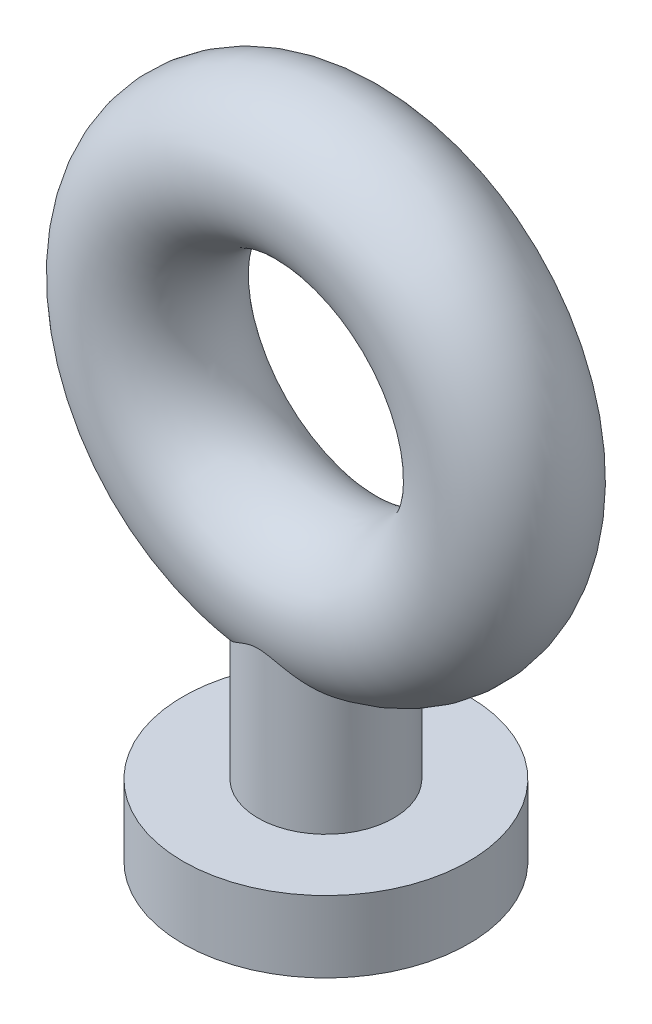
ISO-10303-21;
HEADER;
FILE_DESCRIPTION(('STEP AP214'),'2;1');
FILE_NAME('part.step','',(''),(''),'','','');
FILE_SCHEMA(('AUTOMOTIVE_DESIGN { 1 0 10303 214 1 1 1 1 }'));
ENDSEC;
DATA;
#1=APPLICATION_CONTEXT('core data for automotive mechanical design processes');
#2=APPLICATION_PROTOCOL_DEFINITION('international standard','automotive_design',2000,#1);
#3=PRODUCT_CONTEXT('',#1,'mechanical');
#4=PRODUCT('Part','Part','',(#3));
#5=PRODUCT_RELATED_PRODUCT_CATEGORY('part','',(#4));
#6=PRODUCT_DEFINITION_FORMATION('','',#4);
#7=PRODUCT_DEFINITION_CONTEXT('part definition',#1,'design');
#8=PRODUCT_DEFINITION('design','',#6,#7);
#9=PRODUCT_DEFINITION_SHAPE('','',#8);
#10=(LENGTH_UNIT() NAMED_UNIT(*) SI_UNIT(.MILLI.,.METRE.));
#11=(NAMED_UNIT(*) PLANE_ANGLE_UNIT() SI_UNIT($,.RADIAN.));
#12=(NAMED_UNIT(*) SI_UNIT($,.STERADIAN.) SOLID_ANGLE_UNIT());
#13=UNCERTAINTY_MEASURE_WITH_UNIT(LENGTH_MEASURE(1.E-05),#10,'distance_accuracy_value','');
#14=(GEOMETRIC_REPRESENTATION_CONTEXT(3) GLOBAL_UNCERTAINTY_ASSIGNED_CONTEXT((#13)) GLOBAL_UNIT_ASSIGNED_CONTEXT((#10,
#11,#12)) REPRESENTATION_CONTEXT('',''));
#15=CARTESIAN_POINT('',(0.,0.,0.));
#16=DIRECTION('',(0.,0.,1.));
#17=DIRECTION('',(1.,0.,0.));
#18=AXIS2_PLACEMENT_3D('',#15,#16,#17);
#19=CARTESIAN_POINT('',(0.,0.,0.));
#20=DIRECTION('',(0.,1.,0.));
#21=DIRECTION('',(0.,0.,1.));
#22=AXIS2_PLACEMENT_3D('',#19,#20,#21);
#23=CYLINDRICAL_SURFACE('',#22,0.95);
#24=CARTESIAN_POINT('',(0.,-4.86860505254029,0.));
#25=DIRECTION('',(0.,1.,0.));
#26=DIRECTION('',(0.,0.,1.));
#27=AXIS2_PLACEMENT_3D('',#24,#25,#26);
#28=CIRCLE('',#27,0.95);
#29=CARTESIAN_POINT('',(0.,-4.86860505254029,0.95));
#30=VERTEX_POINT('',#29);
#31=EDGE_CURVE('E66',#30,#30,#28,.T.);
#32=ORIENTED_EDGE('',*,*,#31,.T.);
#33=EDGE_LOOP('',(#32));
#34=FACE_BOUND('',#33,.T.);
#35=CARTESIAN_POINT('',(-0.696763898676524,-3.18828419711268,-0.645770911005669));
#36=CARTESIAN_POINT('',(-0.728218847321771,-3.21079399925205,-0.611830957627065));
#37=CARTESIAN_POINT('',(-0.757673621164826,-3.23187776941266,-0.575075691256959));
#38=CARTESIAN_POINT('',(-0.811501310502905,-3.27033594344044,-0.496227270304893));
#39=CARTESIAN_POINT('',(-0.835874325742483,-3.28771042011365,-0.454134220518818));
#40=CARTESIAN_POINT('',(-0.878466257033363,-3.31800284822494,-0.365033924856872));
#41=CARTESIAN_POINT('',(-0.896642076286018,-3.33088960368,-0.317995127234892));
#42=CARTESIAN_POINT('',(-0.925436310570067,-3.35127183489072,-0.220549542115327));
#43=CARTESIAN_POINT('',(-0.936060459456842,-3.35877140109386,-0.170145341791524));
#44=CARTESIAN_POINT('',(-0.948322769549391,-3.36742370741637,-0.0730153438486468));
#45=CARTESIAN_POINT('',(-0.950769629965446,-3.36914767890903,-0.0264413420422277));
#46=CARTESIAN_POINT('',(-0.948808418492038,-3.36776493098177,0.0664818099568839));
#47=CARTESIAN_POINT('',(-0.944402418717841,-3.36465967178759,0.112831023868705));
#48=CARTESIAN_POINT('',(-0.92946222484854,-3.35411126152607,0.201235732284493));
#49=CARTESIAN_POINT('',(-0.919292662607049,-3.34692617375988,0.243385228369109));
#50=CARTESIAN_POINT('',(-0.893646657893527,-3.32876485179232,0.325166458398984));
#51=CARTESIAN_POINT('',(-0.878169239076485,-3.3177879201037,0.364797727542305));
#52=CARTESIAN_POINT('',(-0.84156838644661,-3.29176331993058,0.442982275142506));
#53=CARTESIAN_POINT('',(-0.820168914123534,-3.27651601329527,0.481338771959613));
#54=CARTESIAN_POINT('',(-0.773098427935392,-3.24290597546141,0.553793673886458));
#55=CARTESIAN_POINT('',(-0.747426902628221,-3.22454287124029,0.587891568307757));
#56=CARTESIAN_POINT('',(-0.688629957631823,-3.18246011816435,0.65620587961971));
#57=CARTESIAN_POINT('',(-0.654963478119058,-3.15834984131443,0.689714167439253));
#58=CARTESIAN_POINT('',(-0.584039856039715,-3.10782146491033,0.750726997825198));
#59=CARTESIAN_POINT('',(-0.546775940033788,-3.08139902099313,0.778219883520198));
#60=CARTESIAN_POINT('',(-0.461293902431149,-3.02173494328938,0.832335894116992));
#61=CARTESIAN_POINT('',(-0.412403897759274,-2.98821291361477,0.857603909527551));
#62=CARTESIAN_POINT('',(-0.335741099856958,-2.93918587695105,0.889121689269841));
#63=CARTESIAN_POINT('',(-0.309631213598694,-2.92305231419944,0.898563797708693));
#64=CARTESIAN_POINT('',(-0.256003626500701,-2.89208399743116,0.915287691187096));
#65=CARTESIAN_POINT('',(-0.228488339402474,-2.87724712783317,0.922573043211896));
#66=CARTESIAN_POINT('',(-0.177546767365494,-2.85326376314162,0.933544695141548));
#67=CARTESIAN_POINT('',(-0.154476690946077,-2.84357670272075,0.937665618098753));
#68=CARTESIAN_POINT('',(-0.107065245076035,-2.82745095050136,0.944247206662159));
#69=CARTESIAN_POINT('',(-0.0827323320424527,-2.82099312099631,0.946717683519849));
#70=CARTESIAN_POINT('',(-0.0385253668218616,-2.81384482082535,0.949416936039279));
#71=CARTESIAN_POINT('',(-0.0188365263228334,-2.81220356214194,0.950017155676853));
#72=CARTESIAN_POINT('',(0.0205359886927932,-2.81229829328721,0.949982084289162));
#73=CARTESIAN_POINT('',(0.0402196608764162,-2.81403508425309,0.949346500181084));
#74=CARTESIAN_POINT('',(0.0849964346940136,-2.82147830061631,0.946532633172589));
#75=CARTESIAN_POINT('',(0.109876558410853,-2.82824768270819,0.943937480896253));
#76=CARTESIAN_POINT('',(0.158308454419732,-2.8450663902744,0.937040154582156));
#77=CARTESIAN_POINT('',(0.181851819714218,-2.85513424519585,0.932728306707764));
#78=CARTESIAN_POINT('',(0.229519650822813,-2.87793922208358,0.922204797159761));
#79=CARTESIAN_POINT('',(0.253543809033717,-2.89082413443579,0.915870240514275));
#80=CARTESIAN_POINT('',(0.300496299525538,-2.91765378276144,0.901556389787493));
#81=CARTESIAN_POINT('',(0.32342341983155,-2.93159964873004,0.893575326123087));
#82=CARTESIAN_POINT('',(0.390884348107463,-2.97407423531471,0.867206894228056));
#83=CARTESIAN_POINT('',(0.434091355700455,-3.00323644942488,0.846395744317719));
#84=CARTESIAN_POINT('',(0.523530338954301,-3.06492469544428,0.794643363622529));
#85=CARTESIAN_POINT('',(0.569259944368337,-3.09730782814545,0.762657245896328));
#86=CARTESIAN_POINT('',(0.655579043929067,-3.1587744508538,0.689847314227872));
#87=CARTESIAN_POINT('',(0.696177963057149,-3.18786398060785,0.649040089755713));
#88=CARTESIAN_POINT('',(0.762915651659737,-3.23562474917575,0.568000587759033));
#89=CARTESIAN_POINT('',(0.790314860244422,-3.25521082126867,0.529348235897745));
#90=CARTESIAN_POINT('',(0.839631877592448,-3.29038879258875,0.44700909354057));
#91=CARTESIAN_POINT('',(0.861551257477193,-3.30598183668801,0.403323751312626));
#92=CARTESIAN_POINT('',(0.898848800807241,-3.33245830331798,0.311513096404165));
#93=CARTESIAN_POINT('',(0.914182454042752,-3.34330968722826,0.263360166194992));
#94=CARTESIAN_POINT('',(0.937051979547711,-3.35947484687004,0.164344263781611));
#95=CARTESIAN_POINT('',(0.944593229751674,-3.36479244176944,0.11348318613362));
#96=CARTESIAN_POINT('',(0.950941113508018,-3.36926883237029,0.0168366346716164));
#97=CARTESIAN_POINT('',(0.950649493203931,-3.36906344827841,-0.0288627249587378));
#98=CARTESIAN_POINT('',(0.943550211474996,-3.36405658804605,-0.119486456059303));
#99=CARTESIAN_POINT('',(0.936744053211345,-3.35925617216089,-0.1644110038749));
#100=CARTESIAN_POINT('',(0.917365839412351,-3.34556066478744,-0.250653771087802));
#101=CARTESIAN_POINT('',(0.905001527033839,-3.33681306340681,-0.292042995148871));
#102=CARTESIAN_POINT('',(0.875198004225997,-3.31567553920812,-0.371952207812546));
#103=CARTESIAN_POINT('',(0.857757573906527,-3.30328474085148,-0.410471503917446));
#104=CARTESIAN_POINT('',(0.817008702536031,-3.27426200688741,-0.486840325111872));
#105=CARTESIAN_POINT('',(0.793349058616358,-3.25737493742377,-0.52440409240209));
#106=CARTESIAN_POINT('',(0.741923653216614,-3.22060808849868,-0.594942906200059));
#107=CARTESIAN_POINT('',(0.714156926485797,-3.20072760550238,-0.627916870461965));
#108=CARTESIAN_POINT('',(0.65063440784964,-3.15528081830851,-0.693972236426796));
#109=CARTESIAN_POINT('',(0.614310945710372,-3.1293135359644,-0.726229607281698));
#110=CARTESIAN_POINT('',(0.538152194610975,-3.07535432807819,-0.784342710438715));
#111=CARTESIAN_POINT('',(0.498311103301728,-3.04735907156823,-0.810187587343362));
#112=CARTESIAN_POINT('',(0.416363886816308,-2.99129460848093,-0.855156262842273));
#113=CARTESIAN_POINT('',(0.374315177584785,-2.96323691254012,-0.874398428381151));
#114=CARTESIAN_POINT('',(0.308701020865761,-2.92264900761148,-0.898745860767624));
#115=CARTESIAN_POINT('',(0.286415270176564,-2.90937434541706,-0.906107051697245));
#116=CARTESIAN_POINT('',(0.240778078045958,-2.8839593924731,-0.919288021082097));
#117=CARTESIAN_POINT('',(0.21742796063809,-2.87181774668027,-0.925109656480418));
#118=CARTESIAN_POINT('',(0.172533173016308,-2.85116133444168,-0.934444287039276));
#119=CARTESIAN_POINT('',(0.151157591829113,-2.84237932246816,-0.93816068474158));
#120=CARTESIAN_POINT('',(0.107305065322955,-2.82760477084777,-0.944177510623013));
#121=CARTESIAN_POINT('',(0.0848330096534443,-2.8216009106366,-0.946483697790136));
#122=CARTESIAN_POINT('',(0.0428331561154131,-2.81435859637301,-0.949226277916959));
#123=CARTESIAN_POINT('',(0.0234355792653986,-2.81249469438447,-0.949909440860042));
#124=CARTESIAN_POINT('',(-0.0153969585580703,-2.812051095747,-0.95007355397331));
#125=CARTESIAN_POINT('',(-0.0348319015485765,-2.81347009032789,-0.949554983230407));
#126=CARTESIAN_POINT('',(-0.0787443165753809,-2.82010710353746,-0.947055686534081));
#127=CARTESIAN_POINT('',(-0.103043001323396,-2.82631066256103,-0.944693313804465));
#128=CARTESIAN_POINT('',(-0.15039146557435,-2.84199162884951,-0.938328469361566));
#129=CARTESIAN_POINT('',(-0.173433274864858,-2.85148762552468,-0.934316660350792));
#130=CARTESIAN_POINT('',(-0.219905584228214,-2.8730624246622,-0.924523589915944));
#131=CARTESIAN_POINT('',(-0.243249109293966,-2.88527605397779,-0.918637583208756));
#132=CARTESIAN_POINT('',(-0.28887797196345,-2.91081126354064,-0.90532534621926));
#133=CARTESIAN_POINT('',(-0.311162093103603,-2.92413407132941,-0.897897395504021));
#134=CARTESIAN_POINT('',(-0.376741585843376,-2.96482209272173,-0.873356306929112));
#135=CARTESIAN_POINT('',(-0.418762847436369,-2.99290624129647,-0.853986204676925));
#136=CARTESIAN_POINT('',(-0.502664069732971,-3.05036842265368,-0.807633936876057));
#137=CARTESIAN_POINT('',(-0.54433509588103,-3.07970240638167,-0.780219491576516));
#138=CARTESIAN_POINT('',(-0.623758893156194,-3.13604702504012,-0.718298592774004));
#139=CARTESIAN_POINT('',(-0.661517132508936,-3.16306089309673,-0.683802243180654));
#140=CARTESIAN_POINT('',(-0.696763898676524,-3.18828419711268,-0.645770911005669));
#141=B_SPLINE_CURVE_WITH_KNOTS('',3,(#35,#36,#37,#38,#39,#40,#41,#42,#43,#44,#45,#46,#47,#48,
#49,#50,#51,#52,#53,#54,#55,#56,#57,#58,#59,#60,#61,#62,#63,#64,#65,#66,#67,#68,#69,#70,#71,#72,
#73,#74,#75,#76,#77,#78,#79,#80,#81,#82,#83,#84,#85,#86,#87,#88,#89,#90,#91,#92,#93,#94,#95,#96,
#97,#98,#99,#100,#101,#102,#103,#104,#105,#106,#107,#108,#109,#110,#111,#112,#113,#114,#115,
#116,#117,#118,#119,#120,#121,#122,#123,#124,#125,#126,#127,#128,#129,#130,#131,#132,#133,#134,
#135,#136,#137,#138,#139,#140),.UNSPECIFIED.,.T.,.F.,(4,2,2,2,2,2,2,2,2,2,2,2,2,2,2,2,2,2,2,2,2,
2,2,2,2,2,2,2,2,2,2,2,2,2,2,2,2,2,2,2,2,2,2,2,2,2,2,2,2,2,2,2,4),(0.,0.154227460973178,
0.308451894490883,0.463727953066375,0.61888598685525,0.758157288184999,0.89738648591378,
1.02865841980354,1.15995451325784,1.29888746939278,1.4378370703001,1.59705356727337,
1.75657591973741,1.94908066019914,2.04533988238975,2.14143900377988,2.21733834393653,
2.29278237943382,2.35176924324655,2.41077009807099,2.48804644621046,2.56576456542176,
2.64960456743886,2.73353515034247,2.90141835198355,3.09421107861823,3.28664433481461,
3.43983340294509,3.59297849974499,3.74714294809216,3.90120092848823,4.03760827251769,
4.17398414957114,4.30563934292942,4.43732620175931,4.57926814526776,4.72124350127635,
4.88589528578994,5.05082392814116,5.21261902809937,5.29345379720107,5.37419061767662,
5.44425989388216,5.51404107758345,5.57224279091753,5.63042130536626,5.70553341266947,
5.78107670835193,5.86194195274978,5.94289791269404,6.10481409143825,6.27787851751532,
6.45069772363931),.UNSPECIFIED.);
#142=CARTESIAN_POINT('',(-0.696763898676524,-3.18828419711268,-0.645770911005669));
#143=VERTEX_POINT('',#142);
#144=EDGE_CURVE('E10',#143,#143,#141,.T.);
#145=ORIENTED_EDGE('',*,*,#144,.F.);
#146=EDGE_LOOP('',(#145));
#147=FACE_BOUND('',#146,.T.);
#148=ADVANCED_FACE('F43',(#34,#147),#23,.T.);
#149=CARTESIAN_POINT('',(0.,-5.8686050525403,0.));
#150=DIRECTION('',(0.,-1.,0.));
#151=DIRECTION('',(0.,0.,-1.));
#152=AXIS2_PLACEMENT_3D('',#149,#150,#151);
#153=PLANE('',#152);
#154=CARTESIAN_POINT('',(0.,-5.8686050525403,0.));
#155=DIRECTION('',(0.,1.,0.));
#156=DIRECTION('',(0.,0.,1.));
#157=AXIS2_PLACEMENT_3D('',#154,#155,#156);
#158=CIRCLE('',#157,2.);
#159=CARTESIAN_POINT('',(0.,-5.8686050525403,2.));
#160=VERTEX_POINT('',#159);
#161=EDGE_CURVE('E56',#160,#160,#158,.T.);
#162=ORIENTED_EDGE('',*,*,#161,.F.);
#163=EDGE_LOOP('',(#162));
#164=FACE_BOUND('',#163,.T.);
#165=ADVANCED_FACE('F84',(#164),#153,.T.);
#166=CARTESIAN_POINT('',(0.,0.,0.));
#167=DIRECTION('',(0.,1.,0.));
#168=DIRECTION('',(0.,0.,1.));
#169=AXIS2_PLACEMENT_3D('',#166,#167,#168);
#170=CYLINDRICAL_SURFACE('',#169,2.);
#171=ORIENTED_EDGE('',*,*,#161,.T.);
#172=EDGE_LOOP('',(#171));
#173=FACE_BOUND('',#172,.T.);
#174=CARTESIAN_POINT('',(0.,-4.86860505254029,0.));
#175=DIRECTION('',(0.,1.,0.));
#176=DIRECTION('',(0.,0.,1.));
#177=AXIS2_PLACEMENT_3D('',#174,#175,#176);
#178=CIRCLE('',#177,2.);
#179=CARTESIAN_POINT('',(0.,-4.86860505254029,2.));
#180=VERTEX_POINT('',#179);
#181=EDGE_CURVE('E61',#180,#180,#178,.T.);
#182=ORIENTED_EDGE('',*,*,#181,.F.);
#183=EDGE_LOOP('',(#182));
#184=FACE_BOUND('',#183,.T.);
#185=ADVANCED_FACE('F77',(#173,#184),#170,.T.);
#186=CARTESIAN_POINT('',(0.,-4.86860505254029,0.));
#187=DIRECTION('',(0.,1.,0.));
#188=DIRECTION('',(0.,0.,1.));
#189=AXIS2_PLACEMENT_3D('',#186,#187,#188);
#190=PLANE('',#189);
#191=ORIENTED_EDGE('',*,*,#181,.T.);
#192=EDGE_LOOP('',(#191));
#193=FACE_BOUND('',#192,.T.);
#194=ORIENTED_EDGE('',*,*,#31,.F.);
#195=EDGE_LOOP('',(#194));
#196=FACE_BOUND('',#195,.T.);
#197=ADVANCED_FACE('F75',(#193,#196),#190,.T.);
#198=CARTESIAN_POINT('',(0.,0.,0.));
#199=DIRECTION('',(0.,0.,-1.));
#200=DIRECTION('',(-1.,0.,0.));
#201=AXIS2_PLACEMENT_3D('',#198,#199,#200);
#202=TOROIDAL_SURFACE('',#201,2.5,1.);
#203=ORIENTED_EDGE('',*,*,#144,.T.);
#204=EDGE_LOOP('',(#203));
#205=FACE_BOUND('',#204,.T.);
#206=ADVANCED_FACE('F45',(#205),#202,.T.);
#207=CLOSED_SHELL('',(#148,#165,#185,#197,#206));
#208=MANIFOLD_SOLID_BREP('B2',#207);
#209=ADVANCED_BREP_SHAPE_REPRESENTATION('',(#18,#208),#14);
#210=SHAPE_DEFINITION_REPRESENTATION(#9,#209);
ENDSEC;
END-ISO-10303-21;
